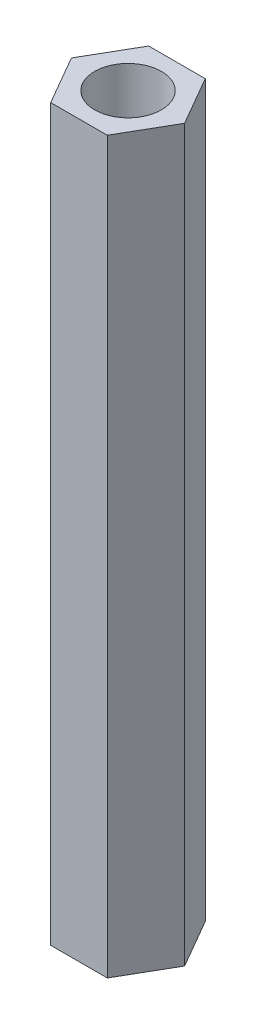
ISO-10303-21;
HEADER;
FILE_DESCRIPTION(('STEP AP214'),'2;1');
FILE_NAME('part.step','',(''),(''),'','','');
FILE_SCHEMA(('AUTOMOTIVE_DESIGN { 1 0 10303 214 1 1 1 1 }'));
ENDSEC;
DATA;
#1=APPLICATION_CONTEXT('core data for automotive mechanical design processes');
#2=APPLICATION_PROTOCOL_DEFINITION('international standard','automotive_design',2000,#1);
#3=PRODUCT_CONTEXT('',#1,'mechanical');
#4=PRODUCT('Part','Part','',(#3));
#5=PRODUCT_RELATED_PRODUCT_CATEGORY('part','',(#4));
#6=PRODUCT_DEFINITION_FORMATION('','',#4);
#7=PRODUCT_DEFINITION_CONTEXT('part definition',#1,'design');
#8=PRODUCT_DEFINITION('design','',#6,#7);
#9=PRODUCT_DEFINITION_SHAPE('','',#8);
#10=(LENGTH_UNIT() NAMED_UNIT(*) SI_UNIT(.MILLI.,.METRE.));
#11=(NAMED_UNIT(*) PLANE_ANGLE_UNIT() SI_UNIT($,.RADIAN.));
#12=(NAMED_UNIT(*) SI_UNIT($,.STERADIAN.) SOLID_ANGLE_UNIT());
#13=UNCERTAINTY_MEASURE_WITH_UNIT(LENGTH_MEASURE(1.E-05),#10,'distance_accuracy_value','');
#14=(GEOMETRIC_REPRESENTATION_CONTEXT(3) GLOBAL_UNCERTAINTY_ASSIGNED_CONTEXT((#13)) GLOBAL_UNIT_ASSIGNED_CONTEXT((#10,
#11,#12)) REPRESENTATION_CONTEXT('',''));
#15=CARTESIAN_POINT('',(0.,0.,0.));
#16=DIRECTION('',(0.,0.,1.));
#17=DIRECTION('',(1.,0.,0.));
#18=AXIS2_PLACEMENT_3D('',#15,#16,#17);
#19=CARTESIAN_POINT('',(1.35677313259562,35.,2.35));
#20=DIRECTION('',(-0.866025403784439,0.,-0.5));
#21=DIRECTION('',(-0.5,0.,0.866025403784439));
#22=AXIS2_PLACEMENT_3D('',#19,#20,#21);
#23=PLANE('',#22);
#24=DIRECTION('',(0.5,0.,-0.866025403784439));
#25=VECTOR('',#24,1.);
#26=CARTESIAN_POINT('',(1.35677313259562,0.,2.35));
#27=LINE('',#26,#25);
#28=CARTESIAN_POINT('',(1.35677313259562,0.,2.35));
#29=VERTEX_POINT('',#28);
#30=CARTESIAN_POINT('',(2.71354626519124,0.,0.));
#31=VERTEX_POINT('',#30);
#32=EDGE_CURVE('E119',#29,#31,#27,.T.);
#33=ORIENTED_EDGE('',*,*,#32,.T.);
#34=DIRECTION('',(0.,-1.,0.));
#35=VECTOR('',#34,1.);
#36=CARTESIAN_POINT('',(2.71354626519124,35.,0.));
#37=LINE('',#36,#35);
#38=CARTESIAN_POINT('',(2.71354626519124,35.,0.));
#39=VERTEX_POINT('',#38);
#40=EDGE_CURVE('E11',#39,#31,#37,.T.);
#41=ORIENTED_EDGE('',*,*,#40,.F.);
#42=DIRECTION('',(0.5,0.,-0.866025403784439));
#43=VECTOR('',#42,1.);
#44=CARTESIAN_POINT('',(1.35677313259562,35.,2.35));
#45=LINE('',#44,#43);
#46=CARTESIAN_POINT('',(1.35677313259562,35.,2.35));
#47=VERTEX_POINT('',#46);
#48=EDGE_CURVE('E130',#47,#39,#45,.T.);
#49=ORIENTED_EDGE('',*,*,#48,.F.);
#50=DIRECTION('',(0.,-1.,0.));
#51=VECTOR('',#50,1.);
#52=CARTESIAN_POINT('',(1.35677313259562,35.,2.35));
#53=LINE('',#52,#51);
#54=EDGE_CURVE('E115',#47,#29,#53,.T.);
#55=ORIENTED_EDGE('',*,*,#54,.T.);
#56=EDGE_LOOP('',(#33,#41,#49,#55));
#57=FACE_BOUND('',#56,.T.);
#58=ADVANCED_FACE('F35',(#57),#23,.F.);
#59=CARTESIAN_POINT('',(2.71354626519124,35.,0.));
#60=DIRECTION('',(-0.866025403784439,0.,0.5));
#61=DIRECTION('',(0.5,0.,0.866025403784439));
#62=AXIS2_PLACEMENT_3D('',#59,#60,#61);
#63=PLANE('',#62);
#64=DIRECTION('',(-0.5,0.,-0.866025403784439));
#65=VECTOR('',#64,1.);
#66=CARTESIAN_POINT('',(2.71354626519124,0.,0.));
#67=LINE('',#66,#65);
#68=CARTESIAN_POINT('',(1.35677313259562,0.,-2.35));
#69=VERTEX_POINT('',#68);
#70=EDGE_CURVE('E122',#31,#69,#67,.T.);
#71=ORIENTED_EDGE('',*,*,#70,.T.);
#72=DIRECTION('',(0.,-1.,0.));
#73=VECTOR('',#72,1.);
#74=CARTESIAN_POINT('',(1.35677313259562,35.,-2.35));
#75=LINE('',#74,#73);
#76=CARTESIAN_POINT('',(1.35677313259562,35.,-2.35));
#77=VERTEX_POINT('',#76);
#78=EDGE_CURVE('E43',#77,#69,#75,.T.);
#79=ORIENTED_EDGE('',*,*,#78,.F.);
#80=DIRECTION('',(-0.5,0.,-0.866025403784439));
#81=VECTOR('',#80,1.);
#82=CARTESIAN_POINT('',(2.71354626519124,35.,0.));
#83=LINE('',#82,#81);
#84=EDGE_CURVE('E88',#39,#77,#83,.T.);
#85=ORIENTED_EDGE('',*,*,#84,.F.);
#86=ORIENTED_EDGE('',*,*,#40,.T.);
#87=EDGE_LOOP('',(#71,#79,#85,#86));
#88=FACE_BOUND('',#87,.T.);
#89=ADVANCED_FACE('F155',(#88),#63,.F.);
#90=CARTESIAN_POINT('',(1.35677313259562,35.,-2.35));
#91=DIRECTION('',(0.,0.,1.));
#92=DIRECTION('',(1.,0.,0.));
#93=AXIS2_PLACEMENT_3D('',#90,#91,#92);
#94=PLANE('',#93);
#95=DIRECTION('',(-1.,0.,0.));
#96=VECTOR('',#95,1.);
#97=CARTESIAN_POINT('',(1.35677313259562,0.,-2.35));
#98=LINE('',#97,#96);
#99=CARTESIAN_POINT('',(-1.35677313259562,0.,-2.35));
#100=VERTEX_POINT('',#99);
#101=EDGE_CURVE('E125',#69,#100,#98,.T.);
#102=ORIENTED_EDGE('',*,*,#101,.T.);
#103=DIRECTION('',(0.,-1.,0.));
#104=VECTOR('',#103,1.);
#105=CARTESIAN_POINT('',(-1.35677313259562,35.,-2.35));
#106=LINE('',#105,#104);
#107=CARTESIAN_POINT('',(-1.35677313259562,35.,-2.35));
#108=VERTEX_POINT('',#107);
#109=EDGE_CURVE('E110',#108,#100,#106,.T.);
#110=ORIENTED_EDGE('',*,*,#109,.F.);
#111=DIRECTION('',(-1.,0.,0.));
#112=VECTOR('',#111,1.);
#113=CARTESIAN_POINT('',(1.35677313259562,35.,-2.35));
#114=LINE('',#113,#112);
#115=EDGE_CURVE('E101',#77,#108,#114,.T.);
#116=ORIENTED_EDGE('',*,*,#115,.F.);
#117=ORIENTED_EDGE('',*,*,#78,.T.);
#118=EDGE_LOOP('',(#102,#110,#116,#117));
#119=FACE_BOUND('',#118,.T.);
#120=ADVANCED_FACE('F136',(#119),#94,.F.);
#121=CARTESIAN_POINT('',(-1.35677313259562,35.,-2.35));
#122=DIRECTION('',(0.866025403784439,0.,0.5));
#123=DIRECTION('',(0.5,0.,-0.866025403784439));
#124=AXIS2_PLACEMENT_3D('',#121,#122,#123);
#125=PLANE('',#124);
#126=DIRECTION('',(-0.5,0.,0.866025403784439));
#127=VECTOR('',#126,1.);
#128=CARTESIAN_POINT('',(-1.35677313259562,0.,-2.35));
#129=LINE('',#128,#127);
#130=CARTESIAN_POINT('',(-2.71354626519124,0.,0.));
#131=VERTEX_POINT('',#130);
#132=EDGE_CURVE('E109',#100,#131,#129,.T.);
#133=ORIENTED_EDGE('',*,*,#132,.T.);
#134=DIRECTION('',(0.,-1.,0.));
#135=VECTOR('',#134,1.);
#136=CARTESIAN_POINT('',(-2.71354626519124,35.,0.));
#137=LINE('',#136,#135);
#138=CARTESIAN_POINT('',(-2.71354626519124,35.,0.));
#139=VERTEX_POINT('',#138);
#140=EDGE_CURVE('E106',#139,#131,#137,.T.);
#141=ORIENTED_EDGE('',*,*,#140,.F.);
#142=DIRECTION('',(-0.5,0.,0.866025403784439));
#143=VECTOR('',#142,1.);
#144=CARTESIAN_POINT('',(-1.35677313259562,35.,-2.35));
#145=LINE('',#144,#143);
#146=EDGE_CURVE('E95',#108,#139,#145,.T.);
#147=ORIENTED_EDGE('',*,*,#146,.F.);
#148=ORIENTED_EDGE('',*,*,#109,.T.);
#149=EDGE_LOOP('',(#133,#141,#147,#148));
#150=FACE_BOUND('',#149,.T.);
#151=ADVANCED_FACE('F107',(#150),#125,.F.);
#152=CARTESIAN_POINT('',(-2.71354626519124,35.,0.));
#153=DIRECTION('',(0.866025403784439,0.,-0.5));
#154=DIRECTION('',(-0.5,0.,-0.866025403784439));
#155=AXIS2_PLACEMENT_3D('',#152,#153,#154);
#156=PLANE('',#155);
#157=DIRECTION('',(0.5,0.,0.866025403784439));
#158=VECTOR('',#157,1.);
#159=CARTESIAN_POINT('',(-2.71354626519124,0.,0.));
#160=LINE('',#159,#158);
#161=CARTESIAN_POINT('',(-1.35677313259562,0.,2.35));
#162=VERTEX_POINT('',#161);
#163=EDGE_CURVE('E74',#131,#162,#160,.T.);
#164=ORIENTED_EDGE('',*,*,#163,.T.);
#165=DIRECTION('',(0.,-1.,0.));
#166=VECTOR('',#165,1.);
#167=CARTESIAN_POINT('',(-1.35677313259562,35.,2.35));
#168=LINE('',#167,#166);
#169=CARTESIAN_POINT('',(-1.35677313259562,35.,2.35));
#170=VERTEX_POINT('',#169);
#171=EDGE_CURVE('E111',#170,#162,#168,.T.);
#172=ORIENTED_EDGE('',*,*,#171,.F.);
#173=DIRECTION('',(0.5,0.,0.866025403784439));
#174=VECTOR('',#173,1.);
#175=CARTESIAN_POINT('',(-2.71354626519124,35.,0.));
#176=LINE('',#175,#174);
#177=EDGE_CURVE('E99',#139,#170,#176,.T.);
#178=ORIENTED_EDGE('',*,*,#177,.F.);
#179=ORIENTED_EDGE('',*,*,#140,.T.);
#180=EDGE_LOOP('',(#164,#172,#178,#179));
#181=FACE_BOUND('',#180,.T.);
#182=ADVANCED_FACE('F113',(#181),#156,.F.);
#183=CARTESIAN_POINT('',(-1.35677313259562,35.,2.35));
#184=DIRECTION('',(0.,0.,-1.));
#185=DIRECTION('',(-1.,0.,0.));
#186=AXIS2_PLACEMENT_3D('',#183,#184,#185);
#187=PLANE('',#186);
#188=DIRECTION('',(1.,0.,0.));
#189=VECTOR('',#188,1.);
#190=CARTESIAN_POINT('',(-1.35677313259562,0.,2.35));
#191=LINE('',#190,#189);
#192=EDGE_CURVE('E80',#162,#29,#191,.T.);
#193=ORIENTED_EDGE('',*,*,#192,.T.);
#194=ORIENTED_EDGE('',*,*,#54,.F.);
#195=DIRECTION('',(1.,0.,0.));
#196=VECTOR('',#195,1.);
#197=CARTESIAN_POINT('',(-1.35677313259562,35.,2.35));
#198=LINE('',#197,#196);
#199=EDGE_CURVE('E51',#170,#47,#198,.T.);
#200=ORIENTED_EDGE('',*,*,#199,.F.);
#201=ORIENTED_EDGE('',*,*,#171,.T.);
#202=EDGE_LOOP('',(#193,#194,#200,#201));
#203=FACE_BOUND('',#202,.T.);
#204=ADVANCED_FACE('F143',(#203),#187,.F.);
#205=CARTESIAN_POINT('',(0.,35.,0.));
#206=DIRECTION('',(0.,1.,0.));
#207=DIRECTION('',(0.,0.,1.));
#208=AXIS2_PLACEMENT_3D('',#205,#206,#207);
#209=PLANE('',#208);
#210=CARTESIAN_POINT('',(0.,35.,0.));
#211=DIRECTION('',(0.,1.,0.));
#212=DIRECTION('',(0.,0.,1.));
#213=AXIS2_PLACEMENT_3D('',#210,#211,#212);
#214=CIRCLE('',#213,1.6);
#215=CARTESIAN_POINT('',(0.,35.,1.6));
#216=VERTEX_POINT('',#215);
#217=EDGE_CURVE('E210',#216,#216,#214,.T.);
#218=ORIENTED_EDGE('',*,*,#217,.F.);
#219=EDGE_LOOP('',(#218));
#220=FACE_BOUND('',#219,.T.);
#221=ORIENTED_EDGE('',*,*,#48,.T.);
#222=ORIENTED_EDGE('',*,*,#84,.T.);
#223=ORIENTED_EDGE('',*,*,#115,.T.);
#224=ORIENTED_EDGE('',*,*,#146,.T.);
#225=ORIENTED_EDGE('',*,*,#177,.T.);
#226=ORIENTED_EDGE('',*,*,#199,.T.);
#227=EDGE_LOOP('',(#221,#222,#223,#224,#225,#226));
#228=FACE_BOUND('',#227,.T.);
#229=ADVANCED_FACE('F97',(#220,#228),#209,.T.);
#230=CARTESIAN_POINT('',(0.,0.,0.));
#231=DIRECTION('',(0.,1.,0.));
#232=DIRECTION('',(0.,0.,1.));
#233=AXIS2_PLACEMENT_3D('',#230,#231,#232);
#234=PLANE('',#233);
#235=CARTESIAN_POINT('',(0.,0.,0.));
#236=DIRECTION('',(0.,1.,0.));
#237=DIRECTION('',(0.,0.,1.));
#238=AXIS2_PLACEMENT_3D('',#235,#236,#237);
#239=CIRCLE('',#238,1.6);
#240=CARTESIAN_POINT('',(0.,0.,1.6));
#241=VERTEX_POINT('',#240);
#242=EDGE_CURVE('E123',#241,#241,#239,.T.);
#243=ORIENTED_EDGE('',*,*,#242,.T.);
#244=EDGE_LOOP('',(#243));
#245=FACE_BOUND('',#244,.T.);
#246=ORIENTED_EDGE('',*,*,#32,.F.);
#247=ORIENTED_EDGE('',*,*,#192,.F.);
#248=ORIENTED_EDGE('',*,*,#163,.F.);
#249=ORIENTED_EDGE('',*,*,#132,.F.);
#250=ORIENTED_EDGE('',*,*,#101,.F.);
#251=ORIENTED_EDGE('',*,*,#70,.F.);
#252=EDGE_LOOP('',(#246,#247,#248,#249,#250,#251));
#253=FACE_BOUND('',#252,.T.);
#254=ADVANCED_FACE('F139',(#245,#253),#234,.F.);
#255=CARTESIAN_POINT('',(0.,0.,0.));
#256=DIRECTION('',(0.,1.,0.));
#257=DIRECTION('',(0.,0.,1.));
#258=AXIS2_PLACEMENT_3D('',#255,#256,#257);
#259=CYLINDRICAL_SURFACE('',#258,1.6);
#260=ORIENTED_EDGE('',*,*,#242,.F.);
#261=EDGE_LOOP('',(#260));
#262=FACE_BOUND('',#261,.T.);
#263=ORIENTED_EDGE('',*,*,#217,.T.);
#264=EDGE_LOOP('',(#263));
#265=FACE_BOUND('',#264,.T.);
#266=ADVANCED_FACE('F192',(#262,#265),#259,.F.);
#267=CLOSED_SHELL('',(#58,#89,#120,#151,#182,#204,#229,#254,#266));
#268=MANIFOLD_SOLID_BREP('B2',#267);
#269=ADVANCED_BREP_SHAPE_REPRESENTATION('',(#18,#268),#14);
#270=SHAPE_DEFINITION_REPRESENTATION(#9,#269);
ENDSEC;
END-ISO-10303-21;
